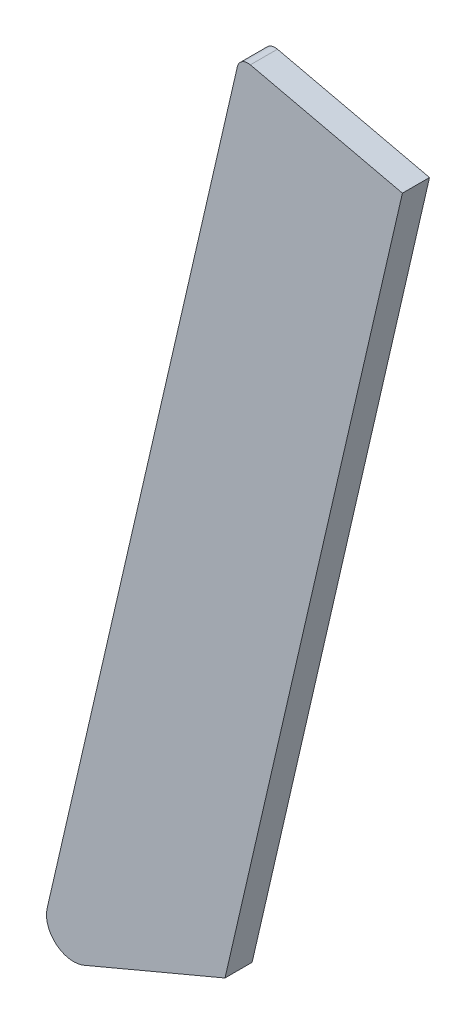
ISO-10303-21;
HEADER;
FILE_DESCRIPTION(('STEP AP214'),'2;1');
FILE_NAME('part.step','',(''),(''),'','','');
FILE_SCHEMA(('AUTOMOTIVE_DESIGN { 1 0 10303 214 1 1 1 1 }'));
ENDSEC;
DATA;
#1=APPLICATION_CONTEXT('core data for automotive mechanical design processes');
#2=APPLICATION_PROTOCOL_DEFINITION('international standard','automotive_design',2000,#1);
#3=PRODUCT_CONTEXT('',#1,'mechanical');
#4=PRODUCT('Part','Part','',(#3));
#5=PRODUCT_RELATED_PRODUCT_CATEGORY('part','',(#4));
#6=PRODUCT_DEFINITION_FORMATION('','',#4);
#7=PRODUCT_DEFINITION_CONTEXT('part definition',#1,'design');
#8=PRODUCT_DEFINITION('design','',#6,#7);
#9=PRODUCT_DEFINITION_SHAPE('','',#8);
#10=(LENGTH_UNIT() NAMED_UNIT(*) SI_UNIT(.MILLI.,.METRE.));
#11=(NAMED_UNIT(*) PLANE_ANGLE_UNIT() SI_UNIT($,.RADIAN.));
#12=(NAMED_UNIT(*) SI_UNIT($,.STERADIAN.) SOLID_ANGLE_UNIT());
#13=UNCERTAINTY_MEASURE_WITH_UNIT(LENGTH_MEASURE(1.E-05),#10,'distance_accuracy_value','');
#14=(GEOMETRIC_REPRESENTATION_CONTEXT(3) GLOBAL_UNCERTAINTY_ASSIGNED_CONTEXT((#13)) GLOBAL_UNIT_ASSIGNED_CONTEXT((#10,
#11,#12)) REPRESENTATION_CONTEXT('',''));
#15=CARTESIAN_POINT('',(0.,0.,0.));
#16=DIRECTION('',(0.,0.,1.));
#17=DIRECTION('',(1.,0.,0.));
#18=AXIS2_PLACEMENT_3D('',#15,#16,#17);
#19=CARTESIAN_POINT('',(-39.7628651036317,-26.5735382503875,3.17499999999908));
#20=DIRECTION('',(0.,0.,-1.));
#21=DIRECTION('',(-1.,0.,0.));
#22=AXIS2_PLACEMENT_3D('',#19,#20,#21);
#23=CYLINDRICAL_SURFACE('',#22,1.27);
#24=CARTESIAN_POINT('',(-39.762865103632,-26.5735382503875,-9.29811783123569E-13));
#25=DIRECTION('',(0.,0.,1.));
#26=DIRECTION('',(1.,0.,0.));
#27=AXIS2_PLACEMENT_3D('',#24,#25,#26);
#28=CIRCLE('',#27,1.27);
#29=CARTESIAN_POINT('',(-39.4771772646153,-25.3360882681103,-9.29811783123569E-13));
#30=VERTEX_POINT('',#29);
#31=CARTESIAN_POINT('',(-41.0003150859092,-26.2878504113708,-9.29811783123569E-13));
#32=VERTEX_POINT('',#31);
#33=EDGE_CURVE('E116',#30,#32,#28,.T.);
#34=ORIENTED_EDGE('',*,*,#33,.T.);
#35=DIRECTION('',(0.,0.,-1.));
#36=VECTOR('',#35,1.);
#37=CARTESIAN_POINT('',(-41.000315085909,-26.2878504113709,3.17499999999908));
#38=LINE('',#37,#36);
#39=CARTESIAN_POINT('',(-41.000315085909,-26.2878504113709,3.17499999999908));
#40=VERTEX_POINT('',#39);
#41=EDGE_CURVE('E11',#40,#32,#38,.T.);
#42=ORIENTED_EDGE('',*,*,#41,.F.);
#43=CARTESIAN_POINT('',(-39.7628651036317,-26.5735382503875,3.17499999999908));
#44=DIRECTION('',(0.,0.,1.));
#45=DIRECTION('',(1.,0.,0.));
#46=AXIS2_PLACEMENT_3D('',#43,#44,#45);
#47=CIRCLE('',#46,1.27);
#48=CARTESIAN_POINT('',(-39.4771772646148,-25.3360882681102,3.17499999999908));
#49=VERTEX_POINT('',#48);
#50=EDGE_CURVE('E126',#49,#40,#47,.T.);
#51=ORIENTED_EDGE('',*,*,#50,.F.);
#52=DIRECTION('',(0.,0.,-1.));
#53=VECTOR('',#52,1.);
#54=CARTESIAN_POINT('',(-39.4771772646148,-25.3360882681102,3.17499999999908));
#55=LINE('',#54,#53);
#56=EDGE_CURVE('E112',#49,#30,#55,.T.);
#57=ORIENTED_EDGE('',*,*,#56,.T.);
#58=EDGE_LOOP('',(#34,#42,#51,#57));
#59=FACE_BOUND('',#58,.T.);
#60=ADVANCED_FACE('F32',(#59),#23,.T.);
#61=CARTESIAN_POINT('',(-41.000315085909,-26.2878504113709,3.17499999999908));
#62=DIRECTION('',(0.974370064785235,-0.224951054343865,0.));
#63=DIRECTION('',(0.224951054343865,0.974370064785235,0.));
#64=AXIS2_PLACEMENT_3D('',#61,#62,#63);
#65=PLANE('',#64);
#66=DIRECTION('',(-0.224951054343865,-0.974370064785235,0.));
#67=VECTOR('',#66,1.);
#68=CARTESIAN_POINT('',(-41.0003150859092,-26.2878504113708,-9.29811783123569E-13));
#69=LINE('',#68,#67);
#70=CARTESIAN_POINT('',(-63.2872946107486,-122.823364533878,-9.29811783123569E-13));
#71=VERTEX_POINT('',#70);
#72=EDGE_CURVE('E119',#32,#71,#69,.T.);
#73=ORIENTED_EDGE('',*,*,#72,.T.);
#74=DIRECTION('',(0.,0.,-1.));
#75=VECTOR('',#74,1.);
#76=CARTESIAN_POINT('',(-63.2872946107486,-122.823364533878,3.17499999999908));
#77=LINE('',#76,#75);
#78=CARTESIAN_POINT('',(-63.2872946107486,-122.823364533878,3.17499999999908));
#79=VERTEX_POINT('',#78);
#80=EDGE_CURVE('E40',#79,#71,#77,.T.);
#81=ORIENTED_EDGE('',*,*,#80,.F.);
#82=DIRECTION('',(-0.224951054343865,-0.974370064785235,0.));
#83=VECTOR('',#82,1.);
#84=CARTESIAN_POINT('',(-41.000315085909,-26.2878504113709,3.17499999999908));
#85=LINE('',#84,#83);
#86=EDGE_CURVE('E85',#40,#79,#85,.T.);
#87=ORIENTED_EDGE('',*,*,#86,.F.);
#88=ORIENTED_EDGE('',*,*,#41,.T.);
#89=EDGE_LOOP('',(#73,#81,#87,#88));
#90=FACE_BOUND('',#89,.T.);
#91=ADVANCED_FACE('F150',(#90),#65,.F.);
#92=CARTESIAN_POINT('',(-60.1936696550555,-123.537584131419,3.17499999999908));
#93=DIRECTION('',(0.,0.,-1.));
#94=DIRECTION('',(-1.,0.,0.));
#95=AXIS2_PLACEMENT_3D('',#92,#93,#94);
#96=CYLINDRICAL_SURFACE('',#95,3.17500000000004);
#97=CARTESIAN_POINT('',(-60.1936696550555,-123.537584131419,-9.29811783123569E-13));
#98=DIRECTION('',(0.,0.,1.));
#99=DIRECTION('',(1.,0.,0.));
#100=AXIS2_PLACEMENT_3D('',#97,#98,#99);
#101=CIRCLE('',#100,3.17500000000004);
#102=CARTESIAN_POINT('',(-58.9599938676809,-126.463104435851,-9.29811783123569E-13));
#103=VERTEX_POINT('',#102);
#104=EDGE_CURVE('E121',#71,#103,#101,.T.);
#105=ORIENTED_EDGE('',*,*,#104,.T.);
#106=DIRECTION('',(0.,0.,-1.));
#107=VECTOR('',#106,1.);
#108=CARTESIAN_POINT('',(-58.9599938676809,-126.463104435851,3.17499999999908));
#109=LINE('',#108,#107);
#110=CARTESIAN_POINT('',(-58.9599938676809,-126.463104435851,3.17499999999908));
#111=VERTEX_POINT('',#110);
#112=EDGE_CURVE('E107',#111,#103,#109,.T.);
#113=ORIENTED_EDGE('',*,*,#112,.F.);
#114=CARTESIAN_POINT('',(-60.1936696550555,-123.537584131419,3.17499999999908));
#115=DIRECTION('',(0.,0.,1.));
#116=DIRECTION('',(1.,0.,0.));
#117=AXIS2_PLACEMENT_3D('',#114,#115,#116);
#118=CIRCLE('',#117,3.17500000000004);
#119=EDGE_CURVE('E98',#79,#111,#118,.T.);
#120=ORIENTED_EDGE('',*,*,#119,.F.);
#121=ORIENTED_EDGE('',*,*,#80,.T.);
#122=EDGE_LOOP('',(#105,#113,#120,#121));
#123=FACE_BOUND('',#122,.T.);
#124=ADVANCED_FACE('F132',(#123),#96,.T.);
#125=CARTESIAN_POINT('',(-58.9599938676809,-126.463104435851,3.17499999999908));
#126=DIRECTION('',(-0.388559303110057,0.921423717931467,0.));
#127=DIRECTION('',(-0.921423717931467,-0.388559303110057,0.));
#128=AXIS2_PLACEMENT_3D('',#125,#126,#127);
#129=PLANE('',#128);
#130=DIRECTION('',(0.921423717931467,0.388559303110057,0.));
#131=VECTOR('',#130,1.);
#132=CARTESIAN_POINT('',(-58.9599938676809,-126.463104435851,-9.29811783123569E-13));
#133=LINE('',#132,#131);
#134=CARTESIAN_POINT('',(-42.4475567953251,-119.499900736377,-9.29811783123569E-13));
#135=VERTEX_POINT('',#134);
#136=EDGE_CURVE('E106',#103,#135,#133,.T.);
#137=ORIENTED_EDGE('',*,*,#136,.T.);
#138=DIRECTION('',(0.,0.,-1.));
#139=VECTOR('',#138,1.);
#140=CARTESIAN_POINT('',(-42.4475567953251,-119.499900736377,3.17499999999943));
#141=LINE('',#140,#139);
#142=CARTESIAN_POINT('',(-42.4475567953251,-119.499900736377,3.17499999999943));
#143=VERTEX_POINT('',#142);
#144=EDGE_CURVE('E103',#143,#135,#141,.T.);
#145=ORIENTED_EDGE('',*,*,#144,.F.);
#146=DIRECTION('',(0.921423717931467,0.388559303110057,0.));
#147=VECTOR('',#146,1.);
#148=CARTESIAN_POINT('',(-58.9599938676809,-126.463104435851,3.17499999999908));
#149=LINE('',#148,#147);
#150=EDGE_CURVE('E92',#111,#143,#149,.T.);
#151=ORIENTED_EDGE('',*,*,#150,.F.);
#152=ORIENTED_EDGE('',*,*,#112,.T.);
#153=EDGE_LOOP('',(#137,#145,#151,#152));
#154=FACE_BOUND('',#153,.T.);
#155=ADVANCED_FACE('F104',(#154),#129,.F.);
#156=CARTESIAN_POINT('',(-42.4475567953251,-119.499900736377,3.17499999999943));
#157=DIRECTION('',(-0.974370064785238,0.224951054343865,0.));
#158=DIRECTION('',(-0.224951054343865,-0.974370064785238,0.));
#159=AXIS2_PLACEMENT_3D('',#156,#157,#158);
#160=PLANE('',#159);
#161=DIRECTION('',(0.224951054343865,0.974370064785238,0.));
#162=VECTOR('',#161,1.);
#163=CARTESIAN_POINT('',(-42.4475567953251,-119.499900736377,-9.29811783123569E-13));
#164=LINE('',#163,#162);
#165=CARTESIAN_POINT('',(-21.6578975198229,-29.4499931499511,0.));
#166=VERTEX_POINT('',#165);
#167=EDGE_CURVE('E71',#135,#166,#164,.T.);
#168=ORIENTED_EDGE('',*,*,#167,.T.);
#169=DIRECTION('',(0.,0.,-1.));
#170=VECTOR('',#169,1.);
#171=CARTESIAN_POINT('',(-21.6578975198227,-29.4499931499509,3.17499999999998));
#172=LINE('',#171,#170);
#173=CARTESIAN_POINT('',(-21.6578975198227,-29.4499931499509,3.17499999999998));
#174=VERTEX_POINT('',#173);
#175=EDGE_CURVE('E108',#174,#166,#172,.T.);
#176=ORIENTED_EDGE('',*,*,#175,.F.);
#177=DIRECTION('',(0.224951054343865,0.974370064785238,0.));
#178=VECTOR('',#177,1.);
#179=CARTESIAN_POINT('',(-42.4475567953251,-119.499900736377,3.17499999999943));
#180=LINE('',#179,#178);
#181=EDGE_CURVE('E96',#143,#174,#180,.T.);
#182=ORIENTED_EDGE('',*,*,#181,.F.);
#183=ORIENTED_EDGE('',*,*,#144,.T.);
#184=EDGE_LOOP('',(#168,#176,#182,#183));
#185=FACE_BOUND('',#184,.T.);
#186=ADVANCED_FACE('F110',(#185),#160,.F.);
#187=CARTESIAN_POINT('',(-21.6578975198227,-29.4499931499509,3.17499999999998));
#188=DIRECTION('',(-0.224951054343865,-0.974370064785235,0.));
#189=DIRECTION('',(0.974370064785237,-0.224951054343865,0.));
#190=AXIS2_PLACEMENT_3D('',#187,#188,#189);
#191=PLANE('',#190);
#192=DIRECTION('',(-0.974370064785238,0.224951054343865,0.));
#193=VECTOR('',#192,1.);
#194=CARTESIAN_POINT('',(-21.6578975198229,-29.4499931499511,0.));
#195=LINE('',#194,#193);
#196=EDGE_CURVE('E77',#166,#30,#195,.T.);
#197=ORIENTED_EDGE('',*,*,#196,.T.);
#198=ORIENTED_EDGE('',*,*,#56,.F.);
#199=DIRECTION('',(-0.974370064785238,0.224951054343865,0.));
#200=VECTOR('',#199,1.);
#201=CARTESIAN_POINT('',(-21.6578975198227,-29.4499931499509,3.17499999999998));
#202=LINE('',#201,#200);
#203=EDGE_CURVE('E48',#174,#49,#202,.T.);
#204=ORIENTED_EDGE('',*,*,#203,.F.);
#205=ORIENTED_EDGE('',*,*,#175,.T.);
#206=EDGE_LOOP('',(#197,#198,#204,#205));
#207=FACE_BOUND('',#206,.T.);
#208=ADVANCED_FACE('F139',(#207),#191,.F.);
#209=CARTESIAN_POINT('',(-39.7628651036317,-26.5735382503875,3.17499999999908));
#210=DIRECTION('',(0.,0.,1.));
#211=DIRECTION('',(1.,0.,0.));
#212=AXIS2_PLACEMENT_3D('',#209,#210,#211);
#213=PLANE('',#212);
#214=ORIENTED_EDGE('',*,*,#50,.T.);
#215=ORIENTED_EDGE('',*,*,#86,.T.);
#216=ORIENTED_EDGE('',*,*,#119,.T.);
#217=ORIENTED_EDGE('',*,*,#150,.T.);
#218=ORIENTED_EDGE('',*,*,#181,.T.);
#219=ORIENTED_EDGE('',*,*,#203,.T.);
#220=EDGE_LOOP('',(#214,#215,#216,#217,#218,#219));
#221=FACE_BOUND('',#220,.T.);
#222=ADVANCED_FACE('F94',(#221),#213,.T.);
#223=CARTESIAN_POINT('',(-39.762865103632,-26.5735382503875,-9.29811783123569E-13));
#224=DIRECTION('',(0.,0.,1.));
#225=DIRECTION('',(1.,0.,0.));
#226=AXIS2_PLACEMENT_3D('',#223,#224,#225);
#227=PLANE('',#226);
#228=ORIENTED_EDGE('',*,*,#33,.F.);
#229=ORIENTED_EDGE('',*,*,#196,.F.);
#230=ORIENTED_EDGE('',*,*,#167,.F.);
#231=ORIENTED_EDGE('',*,*,#136,.F.);
#232=ORIENTED_EDGE('',*,*,#104,.F.);
#233=ORIENTED_EDGE('',*,*,#72,.F.);
#234=EDGE_LOOP('',(#228,#229,#230,#231,#232,#233));
#235=FACE_BOUND('',#234,.T.);
#236=ADVANCED_FACE('F135',(#235),#227,.F.);
#237=CLOSED_SHELL('',(#60,#91,#124,#155,#186,#208,#222,#236));
#238=MANIFOLD_SOLID_BREP('B2',#237);
#239=ADVANCED_BREP_SHAPE_REPRESENTATION('',(#18,#238),#14);
#240=SHAPE_DEFINITION_REPRESENTATION(#9,#239);
ENDSEC;
END-ISO-10303-21;
